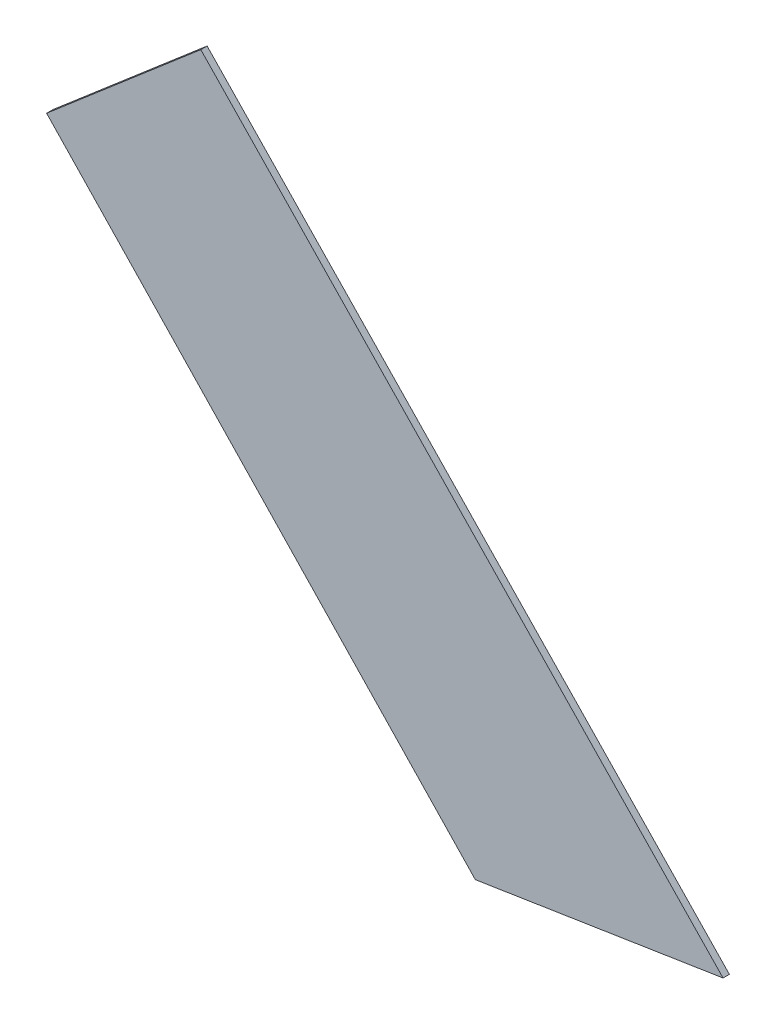
ISO-10303-21;
HEADER;
FILE_DESCRIPTION(('STEP AP214'),'2;1');
FILE_NAME('part.step','',(''),(''),'','','');
FILE_SCHEMA(('AUTOMOTIVE_DESIGN { 1 0 10303 214 1 1 1 1 }'));
ENDSEC;
DATA;
#1=APPLICATION_CONTEXT('core data for automotive mechanical design processes');
#2=APPLICATION_PROTOCOL_DEFINITION('international standard','automotive_design',2000,#1);
#3=PRODUCT_CONTEXT('',#1,'mechanical');
#4=PRODUCT('Part','Part','',(#3));
#5=PRODUCT_RELATED_PRODUCT_CATEGORY('part','',(#4));
#6=PRODUCT_DEFINITION_FORMATION('','',#4);
#7=PRODUCT_DEFINITION_CONTEXT('part definition',#1,'design');
#8=PRODUCT_DEFINITION('design','',#6,#7);
#9=PRODUCT_DEFINITION_SHAPE('','',#8);
#10=(LENGTH_UNIT() NAMED_UNIT(*) SI_UNIT(.MILLI.,.METRE.));
#11=(NAMED_UNIT(*) PLANE_ANGLE_UNIT() SI_UNIT($,.RADIAN.));
#12=(NAMED_UNIT(*) SI_UNIT($,.STERADIAN.) SOLID_ANGLE_UNIT());
#13=UNCERTAINTY_MEASURE_WITH_UNIT(LENGTH_MEASURE(1.E-05),#10,'distance_accuracy_value','');
#14=(GEOMETRIC_REPRESENTATION_CONTEXT(3) GLOBAL_UNCERTAINTY_ASSIGNED_CONTEXT((#13)) GLOBAL_UNIT_ASSIGNED_CONTEXT((#10,
#11,#12)) REPRESENTATION_CONTEXT('',''));
#15=CARTESIAN_POINT('',(0.,0.,0.));
#16=DIRECTION('',(0.,0.,1.));
#17=DIRECTION('',(1.,0.,0.));
#18=AXIS2_PLACEMENT_3D('',#15,#16,#17);
#19=CARTESIAN_POINT('',(35.1442261937971,12.0172672609247,0.1));
#20=DIRECTION('',(-0.720628746874035,-0.693321144332667,0.));
#21=DIRECTION('',(0.693321144332667,-0.720628746874035,0.));
#22=AXIS2_PLACEMENT_3D('',#19,#20,#21);
#23=PLANE('',#22);
#24=DIRECTION('',(-0.693321144332667,0.720628746874035,0.));
#25=VECTOR('',#24,1.);
#26=CARTESIAN_POINT('',(35.1442261937971,12.0172672609247,0.));
#27=LINE('',#26,#25);
#28=CARTESIAN_POINT('',(35.1442261937971,12.0172672609247,0.));
#29=VERTEX_POINT('',#28);
#30=CARTESIAN_POINT('',(26.8919924208779,20.5945289401633,0.));
#31=VERTEX_POINT('',#30);
#32=EDGE_CURVE('E96',#29,#31,#27,.T.);
#33=ORIENTED_EDGE('',*,*,#32,.T.);
#34=DIRECTION('',(0.,0.,-1.));
#35=VECTOR('',#34,1.);
#36=CARTESIAN_POINT('',(26.8919924208779,20.5945289401633,0.1));
#37=LINE('',#36,#35);
#38=CARTESIAN_POINT('',(26.8919924208779,20.5945289401633,0.1));
#39=VERTEX_POINT('',#38);
#40=EDGE_CURVE('E11',#39,#31,#37,.T.);
#41=ORIENTED_EDGE('',*,*,#40,.F.);
#42=DIRECTION('',(-0.693321144332667,0.720628746874035,0.));
#43=VECTOR('',#42,1.);
#44=CARTESIAN_POINT('',(35.1442261937971,12.0172672609247,0.1));
#45=LINE('',#44,#43);
#46=CARTESIAN_POINT('',(35.1442261937971,12.0172672609247,0.1));
#47=VERTEX_POINT('',#46);
#48=EDGE_CURVE('E84',#47,#39,#45,.T.);
#49=ORIENTED_EDGE('',*,*,#48,.F.);
#50=DIRECTION('',(0.,0.,-1.));
#51=VECTOR('',#50,1.);
#52=CARTESIAN_POINT('',(35.1442261937971,12.0172672609247,0.1));
#53=LINE('',#52,#51);
#54=EDGE_CURVE('E92',#47,#29,#53,.T.);
#55=ORIENTED_EDGE('',*,*,#54,.T.);
#56=EDGE_LOOP('',(#33,#41,#49,#55));
#57=FACE_BOUND('',#56,.T.);
#58=ADVANCED_FACE('F33',(#57),#23,.F.);
#59=CARTESIAN_POINT('',(26.8919924208779,20.5945289401633,0.1));
#60=DIRECTION('',(0.650791373455964,-0.759256602365301,0.));
#61=DIRECTION('',(0.759256602365301,0.650791373455964,0.));
#62=AXIS2_PLACEMENT_3D('',#59,#60,#61);
#63=PLANE('',#62);
#64=DIRECTION('',(-0.759256602365301,-0.650791373455964,0.));
#65=VECTOR('',#64,1.);
#66=CARTESIAN_POINT('',(26.8919924208779,20.5945289401633,0.));
#67=LINE('',#66,#65);
#68=CARTESIAN_POINT('',(24.4557738062029,18.5063415561562,0.));
#69=VERTEX_POINT('',#68);
#70=EDGE_CURVE('E88',#31,#69,#67,.T.);
#71=ORIENTED_EDGE('',*,*,#70,.T.);
#72=DIRECTION('',(0.,0.,-1.));
#73=VECTOR('',#72,1.);
#74=CARTESIAN_POINT('',(24.4557738062029,18.5063415561562,0.1));
#75=LINE('',#74,#73);
#76=CARTESIAN_POINT('',(24.4557738062029,18.5063415561562,0.1));
#77=VERTEX_POINT('',#76);
#78=EDGE_CURVE('E41',#77,#69,#75,.T.);
#79=ORIENTED_EDGE('',*,*,#78,.F.);
#80=DIRECTION('',(-0.759256602365301,-0.650791373455964,0.));
#81=VECTOR('',#80,1.);
#82=CARTESIAN_POINT('',(26.8919924208779,20.5945289401633,0.1));
#83=LINE('',#82,#81);
#84=EDGE_CURVE('E79',#39,#77,#83,.T.);
#85=ORIENTED_EDGE('',*,*,#84,.F.);
#86=ORIENTED_EDGE('',*,*,#40,.T.);
#87=EDGE_LOOP('',(#71,#79,#85,#86));
#88=FACE_BOUND('',#87,.T.);
#89=ADVANCED_FACE('F87',(#88),#63,.F.);
#90=CARTESIAN_POINT('',(24.4557738062029,18.5063415561562,0.1));
#91=DIRECTION('',(0.723560127221469,0.690261357961787,0.));
#92=DIRECTION('',(-0.690261357961787,0.723560127221469,0.));
#93=AXIS2_PLACEMENT_3D('',#90,#91,#92);
#94=PLANE('',#93);
#95=DIRECTION('',(0.690261357961788,-0.723560127221469,0.));
#96=VECTOR('',#95,1.);
#97=CARTESIAN_POINT('',(24.4557738062029,18.5063415561562,0.));
#98=LINE('',#97,#96);
#99=CARTESIAN_POINT('',(31.2298570193317,11.4054710598367,0.));
#100=VERTEX_POINT('',#99);
#101=EDGE_CURVE('E66',#69,#100,#98,.T.);
#102=ORIENTED_EDGE('',*,*,#101,.T.);
#103=DIRECTION('',(0.,0.,-1.));
#104=VECTOR('',#103,1.);
#105=CARTESIAN_POINT('',(31.2298570193317,11.4054710598367,0.1));
#106=LINE('',#105,#104);
#107=CARTESIAN_POINT('',(31.2298570193317,11.4054710598367,0.1));
#108=VERTEX_POINT('',#107);
#109=EDGE_CURVE('E89',#108,#100,#106,.T.);
#110=ORIENTED_EDGE('',*,*,#109,.F.);
#111=DIRECTION('',(0.690261357961788,-0.723560127221469,0.));
#112=VECTOR('',#111,1.);
#113=CARTESIAN_POINT('',(24.4557738062029,18.5063415561562,0.1));
#114=LINE('',#113,#112);
#115=EDGE_CURVE('E82',#77,#108,#114,.T.);
#116=ORIENTED_EDGE('',*,*,#115,.F.);
#117=ORIENTED_EDGE('',*,*,#78,.T.);
#118=EDGE_LOOP('',(#102,#110,#116,#117));
#119=FACE_BOUND('',#118,.T.);
#120=ADVANCED_FACE('F90',(#119),#94,.F.);
#121=CARTESIAN_POINT('',(35.1442261937971,12.0172672609247,0.1));
#122=DIRECTION('',(-0.154420248982364,0.988005256415281,0.));
#123=DIRECTION('',(-0.988005256415281,-0.154420248982364,0.));
#124=AXIS2_PLACEMENT_3D('',#121,#122,#123);
#125=PLANE('',#124);
#126=DIRECTION('',(0.988005256415281,0.154420248982364,0.));
#127=VECTOR('',#126,1.);
#128=CARTESIAN_POINT('',(35.1442261937971,12.0172672609247,0.));
#129=LINE('',#128,#127);
#130=EDGE_CURVE('E72',#100,#29,#129,.T.);
#131=ORIENTED_EDGE('',*,*,#130,.T.);
#132=ORIENTED_EDGE('',*,*,#54,.F.);
#133=DIRECTION('',(0.988005256415281,0.154420248982364,0.));
#134=VECTOR('',#133,1.);
#135=CARTESIAN_POINT('',(35.1442261937971,12.0172672609247,0.1));
#136=LINE('',#135,#134);
#137=EDGE_CURVE('E49',#108,#47,#136,.T.);
#138=ORIENTED_EDGE('',*,*,#137,.F.);
#139=ORIENTED_EDGE('',*,*,#109,.T.);
#140=EDGE_LOOP('',(#131,#132,#138,#139));
#141=FACE_BOUND('',#140,.T.);
#142=ADVANCED_FACE('F103',(#141),#125,.F.);
#143=CARTESIAN_POINT('',(0.,0.,0.1));
#144=DIRECTION('',(0.,0.,1.));
#145=DIRECTION('',(1.,0.,0.));
#146=AXIS2_PLACEMENT_3D('',#143,#144,#145);
#147=PLANE('',#146);
#148=ORIENTED_EDGE('',*,*,#48,.T.);
#149=ORIENTED_EDGE('',*,*,#84,.T.);
#150=ORIENTED_EDGE('',*,*,#115,.T.);
#151=ORIENTED_EDGE('',*,*,#137,.T.);
#152=EDGE_LOOP('',(#148,#149,#150,#151));
#153=FACE_BOUND('',#152,.T.);
#154=ADVANCED_FACE('F80',(#153),#147,.T.);
#155=CARTESIAN_POINT('',(0.,0.,0.));
#156=DIRECTION('',(0.,0.,1.));
#157=DIRECTION('',(1.,0.,0.));
#158=AXIS2_PLACEMENT_3D('',#155,#156,#157);
#159=PLANE('',#158);
#160=ORIENTED_EDGE('',*,*,#32,.F.);
#161=ORIENTED_EDGE('',*,*,#130,.F.);
#162=ORIENTED_EDGE('',*,*,#101,.F.);
#163=ORIENTED_EDGE('',*,*,#70,.F.);
#164=EDGE_LOOP('',(#160,#161,#162,#163));
#165=FACE_BOUND('',#164,.T.);
#166=ADVANCED_FACE('F106',(#165),#159,.F.);
#167=CLOSED_SHELL('',(#58,#89,#120,#142,#154,#166));
#168=MANIFOLD_SOLID_BREP('B2',#167);
#169=ADVANCED_BREP_SHAPE_REPRESENTATION('',(#18,#168),#14);
#170=SHAPE_DEFINITION_REPRESENTATION(#9,#169);
ENDSEC;
END-ISO-10303-21;
